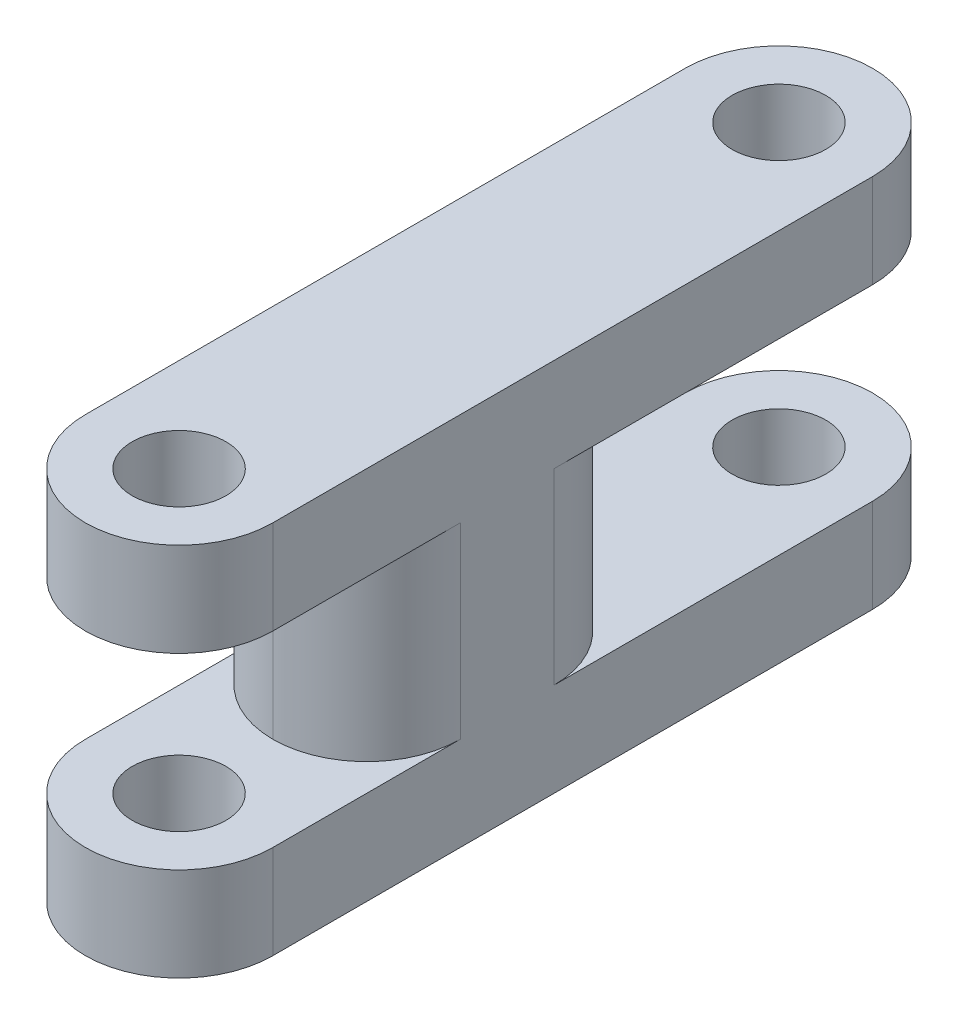
ISO-10303-21;
HEADER;
FILE_DESCRIPTION(('STEP AP214'),'2;1');
FILE_NAME('part.step','',(''),(''),'','','');
FILE_SCHEMA(('AUTOMOTIVE_DESIGN { 1 0 10303 214 1 1 1 1 }'));
ENDSEC;
DATA;
#1=APPLICATION_CONTEXT('core data for automotive mechanical design processes');
#2=APPLICATION_PROTOCOL_DEFINITION('international standard','automotive_design',2000,#1);
#3=PRODUCT_CONTEXT('',#1,'mechanical');
#4=PRODUCT('Part','Part','',(#3));
#5=PRODUCT_RELATED_PRODUCT_CATEGORY('part','',(#4));
#6=PRODUCT_DEFINITION_FORMATION('','',#4);
#7=PRODUCT_DEFINITION_CONTEXT('part definition',#1,'design');
#8=PRODUCT_DEFINITION('design','',#6,#7);
#9=PRODUCT_DEFINITION_SHAPE('','',#8);
#10=(LENGTH_UNIT() NAMED_UNIT(*) SI_UNIT(.MILLI.,.METRE.));
#11=(NAMED_UNIT(*) PLANE_ANGLE_UNIT() SI_UNIT($,.RADIAN.));
#12=(NAMED_UNIT(*) SI_UNIT($,.STERADIAN.) SOLID_ANGLE_UNIT());
#13=UNCERTAINTY_MEASURE_WITH_UNIT(LENGTH_MEASURE(1.E-05),#10,'distance_accuracy_value','');
#14=(GEOMETRIC_REPRESENTATION_CONTEXT(3) GLOBAL_UNCERTAINTY_ASSIGNED_CONTEXT((#13)) GLOBAL_UNIT_ASSIGNED_CONTEXT((#10,
#11,#12)) REPRESENTATION_CONTEXT('',''));
#15=CARTESIAN_POINT('',(0.,0.,0.));
#16=DIRECTION('',(0.,0.,1.));
#17=DIRECTION('',(1.,0.,0.));
#18=AXIS2_PLACEMENT_3D('',#15,#16,#17);
#19=CARTESIAN_POINT('',(0.,20.,-32.));
#20=DIRECTION('',(0.,-1.,0.));
#21=DIRECTION('',(0.,0.,-1.));
#22=AXIS2_PLACEMENT_3D('',#19,#20,#21);
#23=CYLINDRICAL_SURFACE('',#22,5.);
#24=CARTESIAN_POINT('',(0.,15.,-32.));
#25=DIRECTION('',(0.,-1.,0.));
#26=DIRECTION('',(0.,0.,-1.));
#27=AXIS2_PLACEMENT_3D('',#24,#25,#26);
#28=CIRCLE('',#27,5.);
#29=CARTESIAN_POINT('',(-5.,15.,-32.));
#30=VERTEX_POINT('',#29);
#31=CARTESIAN_POINT('',(5.,15.,-32.));
#32=VERTEX_POINT('',#31);
#33=EDGE_CURVE('E140',#30,#32,#28,.T.);
#34=ORIENTED_EDGE('',*,*,#33,.F.);
#35=DIRECTION('',(0.,-1.,0.));
#36=VECTOR('',#35,1.);
#37=CARTESIAN_POINT('',(-5.,20.,-32.));
#38=LINE('',#37,#36);
#39=CARTESIAN_POINT('',(-5.,20.,-32.));
#40=VERTEX_POINT('',#39);
#41=EDGE_CURVE('E173',#40,#30,#38,.T.);
#42=ORIENTED_EDGE('',*,*,#41,.F.);
#43=CARTESIAN_POINT('',(0.,20.,-32.));
#44=DIRECTION('',(0.,1.,0.));
#45=DIRECTION('',(0.,0.,1.));
#46=AXIS2_PLACEMENT_3D('',#43,#44,#45);
#47=CIRCLE('',#46,5.);
#48=CARTESIAN_POINT('',(5.,20.,-32.));
#49=VERTEX_POINT('',#48);
#50=EDGE_CURVE('E164',#49,#40,#47,.T.);
#51=ORIENTED_EDGE('',*,*,#50,.F.);
#52=DIRECTION('',(0.,-1.,0.));
#53=VECTOR('',#52,1.);
#54=CARTESIAN_POINT('',(5.,20.,-32.));
#55=LINE('',#54,#53);
#56=EDGE_CURVE('E156',#49,#32,#55,.T.);
#57=ORIENTED_EDGE('',*,*,#56,.T.);
#58=EDGE_LOOP('',(#34,#42,#51,#57));
#59=FACE_BOUND('',#58,.T.);
#60=ADVANCED_FACE('F39',(#59),#23,.T.);
#61=CARTESIAN_POINT('',(5.,20.,0.));
#62=DIRECTION('',(-1.,0.,0.));
#63=DIRECTION('',(0.,0.,1.));
#64=AXIS2_PLACEMENT_3D('',#61,#62,#63);
#65=PLANE('',#64);
#66=DIRECTION('',(0.,1.,0.));
#67=VECTOR('',#66,1.);
#68=CARTESIAN_POINT('',(5.,20.,-15.));
#69=LINE('',#68,#67);
#70=CARTESIAN_POINT('',(5.,5.,-15.));
#71=VERTEX_POINT('',#70);
#72=CARTESIAN_POINT('',(5.,15.,-15.));
#73=VERTEX_POINT('',#72);
#74=EDGE_CURVE('E159',#71,#73,#69,.T.);
#75=ORIENTED_EDGE('',*,*,#74,.T.);
#76=DIRECTION('',(0.,0.,-1.));
#77=VECTOR('',#76,1.);
#78=CARTESIAN_POINT('',(5.,15.,-35.));
#79=LINE('',#78,#77);
#80=EDGE_CURVE('E143',#73,#32,#79,.T.);
#81=ORIENTED_EDGE('',*,*,#80,.T.);
#82=ORIENTED_EDGE('',*,*,#56,.F.);
#83=DIRECTION('',(0.,0.,-1.));
#84=VECTOR('',#83,1.);
#85=CARTESIAN_POINT('',(5.,20.,0.));
#86=LINE('',#85,#84);
#87=CARTESIAN_POINT('',(5.,20.,0.));
#88=VERTEX_POINT('',#87);
#89=EDGE_CURVE('E292',#88,#49,#86,.T.);
#90=ORIENTED_EDGE('',*,*,#89,.F.);
#91=DIRECTION('',(0.,-1.,0.));
#92=VECTOR('',#91,1.);
#93=CARTESIAN_POINT('',(5.,20.,0.));
#94=LINE('',#93,#92);
#95=CARTESIAN_POINT('',(5.,15.,0.));
#96=VERTEX_POINT('',#95);
#97=EDGE_CURVE('E171',#88,#96,#94,.T.);
#98=ORIENTED_EDGE('',*,*,#97,.T.);
#99=DIRECTION('',(0.,0.,1.));
#100=VECTOR('',#99,1.);
#101=CARTESIAN_POINT('',(5.,15.,5.));
#102=LINE('',#101,#100);
#103=CARTESIAN_POINT('',(5.,15.,-10.));
#104=VERTEX_POINT('',#103);
#105=EDGE_CURVE('E185',#104,#96,#102,.T.);
#106=ORIENTED_EDGE('',*,*,#105,.F.);
#107=DIRECTION('',(0.,1.,0.));
#108=VECTOR('',#107,1.);
#109=CARTESIAN_POINT('',(5.,20.,-10.));
#110=LINE('',#109,#108);
#111=CARTESIAN_POINT('',(5.,5.,-10.));
#112=VERTEX_POINT('',#111);
#113=EDGE_CURVE('E203',#104,#112,#110,.F.);
#114=ORIENTED_EDGE('',*,*,#113,.T.);
#115=DIRECTION('',(0.,0.,-1.));
#116=VECTOR('',#115,1.);
#117=CARTESIAN_POINT('',(5.,5.,5.));
#118=LINE('',#117,#116);
#119=CARTESIAN_POINT('',(5.,5.,0.));
#120=VERTEX_POINT('',#119);
#121=EDGE_CURVE('E255',#120,#112,#118,.T.);
#122=ORIENTED_EDGE('',*,*,#121,.F.);
#123=CARTESIAN_POINT('',(5.,0.,0.));
#124=VERTEX_POINT('',#123);
#125=EDGE_CURVE('E166',#120,#124,#94,.T.);
#126=ORIENTED_EDGE('',*,*,#125,.T.);
#127=DIRECTION('',(0.,0.,-1.));
#128=VECTOR('',#127,1.);
#129=CARTESIAN_POINT('',(5.,0.,0.));
#130=LINE('',#129,#128);
#131=CARTESIAN_POINT('',(5.,0.,-32.));
#132=VERTEX_POINT('',#131);
#133=EDGE_CURVE('E305',#124,#132,#130,.T.);
#134=ORIENTED_EDGE('',*,*,#133,.T.);
#135=CARTESIAN_POINT('',(5.,5.,-32.));
#136=VERTEX_POINT('',#135);
#137=EDGE_CURVE('E167',#136,#132,#55,.T.);
#138=ORIENTED_EDGE('',*,*,#137,.F.);
#139=DIRECTION('',(0.,0.,1.));
#140=VECTOR('',#139,1.);
#141=CARTESIAN_POINT('',(5.,5.,-35.));
#142=LINE('',#141,#140);
#143=EDGE_CURVE('E161',#136,#71,#142,.T.);
#144=ORIENTED_EDGE('',*,*,#143,.T.);
#145=EDGE_LOOP('',(#75,#81,#82,#90,#98,#106,#114,#122,#126,#134,#138,#144));
#146=FACE_BOUND('',#145,.T.);
#147=ADVANCED_FACE('F155',(#146),#65,.F.);
#148=CARTESIAN_POINT('',(-5.,5.,-32.));
#149=VERTEX_POINT('',#148);
#150=CARTESIAN_POINT('',(-5.,0.,-32.));
#151=VERTEX_POINT('',#150);
#152=EDGE_CURVE('E318',#149,#151,#38,.T.);
#153=ORIENTED_EDGE('',*,*,#152,.F.);
#154=CARTESIAN_POINT('',(0.,5.,-32.));
#155=DIRECTION('',(0.,1.,0.));
#156=DIRECTION('',(0.,0.,1.));
#157=AXIS2_PLACEMENT_3D('',#154,#155,#156);
#158=CIRCLE('',#157,5.);
#159=EDGE_CURVE('E252',#136,#149,#158,.T.);
#160=ORIENTED_EDGE('',*,*,#159,.F.);
#161=ORIENTED_EDGE('',*,*,#137,.T.);
#162=CARTESIAN_POINT('',(0.,0.,-32.));
#163=DIRECTION('',(0.,1.,0.));
#164=DIRECTION('',(0.,0.,1.));
#165=AXIS2_PLACEMENT_3D('',#162,#163,#164);
#166=CIRCLE('',#165,5.);
#167=EDGE_CURVE('E309',#132,#151,#166,.T.);
#168=ORIENTED_EDGE('',*,*,#167,.T.);
#169=EDGE_LOOP('',(#153,#160,#161,#168));
#170=FACE_BOUND('',#169,.T.);
#171=ADVANCED_FACE('F365',(#170),#23,.T.);
#172=CARTESIAN_POINT('',(-5.,20.,0.));
#173=DIRECTION('',(1.,0.,0.));
#174=DIRECTION('',(0.,0.,-1.));
#175=AXIS2_PLACEMENT_3D('',#172,#173,#174);
#176=PLANE('',#175);
#177=DIRECTION('',(0.,-1.,0.));
#178=VECTOR('',#177,1.);
#179=CARTESIAN_POINT('',(-5.,20.,-15.));
#180=LINE('',#179,#178);
#181=CARTESIAN_POINT('',(-5.,15.,-15.));
#182=VERTEX_POINT('',#181);
#183=CARTESIAN_POINT('',(-5.,5.,-15.));
#184=VERTEX_POINT('',#183);
#185=EDGE_CURVE('E221',#182,#184,#180,.T.);
#186=ORIENTED_EDGE('',*,*,#185,.T.);
#187=DIRECTION('',(0.,0.,1.));
#188=VECTOR('',#187,1.);
#189=CARTESIAN_POINT('',(-5.,5.,0.));
#190=LINE('',#189,#188);
#191=EDGE_CURVE('E199',#149,#184,#190,.T.);
#192=ORIENTED_EDGE('',*,*,#191,.F.);
#193=ORIENTED_EDGE('',*,*,#152,.T.);
#194=DIRECTION('',(0.,0.,1.));
#195=VECTOR('',#194,1.);
#196=CARTESIAN_POINT('',(-5.,0.,0.));
#197=LINE('',#196,#195);
#198=CARTESIAN_POINT('',(-5.,0.,0.));
#199=VERTEX_POINT('',#198);
#200=EDGE_CURVE('E293',#151,#199,#197,.T.);
#201=ORIENTED_EDGE('',*,*,#200,.T.);
#202=DIRECTION('',(0.,-1.,0.));
#203=VECTOR('',#202,1.);
#204=CARTESIAN_POINT('',(-5.,20.,0.));
#205=LINE('',#204,#203);
#206=CARTESIAN_POINT('',(-5.,5.,0.));
#207=VERTEX_POINT('',#206);
#208=EDGE_CURVE('E301',#207,#199,#205,.T.);
#209=ORIENTED_EDGE('',*,*,#208,.F.);
#210=DIRECTION('',(0.,0.,-1.));
#211=VECTOR('',#210,1.);
#212=CARTESIAN_POINT('',(-5.,5.,0.));
#213=LINE('',#212,#211);
#214=CARTESIAN_POINT('',(-5.,5.,-10.));
#215=VERTEX_POINT('',#214);
#216=EDGE_CURVE('E184',#207,#215,#213,.T.);
#217=ORIENTED_EDGE('',*,*,#216,.T.);
#218=DIRECTION('',(0.,1.,0.));
#219=VECTOR('',#218,1.);
#220=CARTESIAN_POINT('',(-5.,20.,-10.));
#221=LINE('',#220,#219);
#222=CARTESIAN_POINT('',(-5.,15.,-10.));
#223=VERTEX_POINT('',#222);
#224=EDGE_CURVE('E179',#215,#223,#221,.T.);
#225=ORIENTED_EDGE('',*,*,#224,.T.);
#226=DIRECTION('',(0.,0.,1.));
#227=VECTOR('',#226,1.);
#228=CARTESIAN_POINT('',(-5.,15.,0.));
#229=LINE('',#228,#227);
#230=CARTESIAN_POINT('',(-5.,15.,0.));
#231=VERTEX_POINT('',#230);
#232=EDGE_CURVE('E190',#223,#231,#229,.T.);
#233=ORIENTED_EDGE('',*,*,#232,.T.);
#234=CARTESIAN_POINT('',(-5.,20.,0.));
#235=VERTEX_POINT('',#234);
#236=EDGE_CURVE('E315',#235,#231,#205,.T.);
#237=ORIENTED_EDGE('',*,*,#236,.F.);
#238=DIRECTION('',(0.,0.,1.));
#239=VECTOR('',#238,1.);
#240=CARTESIAN_POINT('',(-5.,20.,0.));
#241=LINE('',#240,#239);
#242=EDGE_CURVE('E298',#40,#235,#241,.T.);
#243=ORIENTED_EDGE('',*,*,#242,.F.);
#244=ORIENTED_EDGE('',*,*,#41,.T.);
#245=DIRECTION('',(0.,0.,-1.));
#246=VECTOR('',#245,1.);
#247=CARTESIAN_POINT('',(-5.,15.,0.));
#248=LINE('',#247,#246);
#249=EDGE_CURVE('E145',#182,#30,#248,.T.);
#250=ORIENTED_EDGE('',*,*,#249,.F.);
#251=EDGE_LOOP('',(#186,#192,#193,#201,#209,#217,#225,#233,#237,#243,#244,#250));
#252=FACE_BOUND('',#251,.T.);
#253=ADVANCED_FACE('F243',(#252),#176,.F.);
#254=CARTESIAN_POINT('',(0.,20.,-32.));
#255=DIRECTION('',(0.,-1.,0.));
#256=DIRECTION('',(0.,0.,-1.));
#257=AXIS2_PLACEMENT_3D('',#254,#255,#256);
#258=CYLINDRICAL_SURFACE('',#257,2.5);
#259=CARTESIAN_POINT('',(0.,0.,-32.));
#260=DIRECTION('',(0.,1.,0.));
#261=DIRECTION('',(0.,0.,1.));
#262=AXIS2_PLACEMENT_3D('',#259,#260,#261);
#263=CIRCLE('',#262,2.5);
#264=CARTESIAN_POINT('',(0.,0.,-29.5));
#265=VERTEX_POINT('',#264);
#266=EDGE_CURVE('E276',#265,#265,#263,.T.);
#267=ORIENTED_EDGE('',*,*,#266,.F.);
#268=EDGE_LOOP('',(#267));
#269=FACE_BOUND('',#268,.T.);
#270=CARTESIAN_POINT('',(0.,5.,-32.));
#271=DIRECTION('',(0.,1.,0.));
#272=DIRECTION('',(0.,0.,1.));
#273=AXIS2_PLACEMENT_3D('',#270,#271,#272);
#274=CIRCLE('',#273,2.5);
#275=CARTESIAN_POINT('',(0.,5.,-29.5));
#276=VERTEX_POINT('',#275);
#277=EDGE_CURVE('E151',#276,#276,#274,.T.);
#278=ORIENTED_EDGE('',*,*,#277,.T.);
#279=EDGE_LOOP('',(#278));
#280=FACE_BOUND('',#279,.T.);
#281=ADVANCED_FACE('F376',(#269,#280),#258,.F.);
#282=CARTESIAN_POINT('',(0.,20.,-32.));
#283=DIRECTION('',(0.,1.,0.));
#284=DIRECTION('',(0.,0.,1.));
#285=AXIS2_PLACEMENT_3D('',#282,#283,#284);
#286=CIRCLE('',#285,2.5);
#287=CARTESIAN_POINT('',(0.,20.,-29.5));
#288=VERTEX_POINT('',#287);
#289=EDGE_CURVE('E280',#288,#288,#286,.T.);
#290=ORIENTED_EDGE('',*,*,#289,.T.);
#291=EDGE_LOOP('',(#290));
#292=FACE_BOUND('',#291,.T.);
#293=CARTESIAN_POINT('',(0.,15.,-32.));
#294=DIRECTION('',(0.,-1.,0.));
#295=DIRECTION('',(0.,0.,-1.));
#296=AXIS2_PLACEMENT_3D('',#293,#294,#295);
#297=CIRCLE('',#296,2.5);
#298=CARTESIAN_POINT('',(0.,15.,-34.5));
#299=VERTEX_POINT('',#298);
#300=EDGE_CURVE('E192',#299,#299,#297,.T.);
#301=ORIENTED_EDGE('',*,*,#300,.T.);
#302=EDGE_LOOP('',(#301));
#303=FACE_BOUND('',#302,.T.);
#304=ADVANCED_FACE('F467',(#292,#303),#258,.F.);
#305=CARTESIAN_POINT('',(0.,20.,0.));
#306=DIRECTION('',(0.,-1.,0.));
#307=DIRECTION('',(0.,0.,-1.));
#308=AXIS2_PLACEMENT_3D('',#305,#306,#307);
#309=CYLINDRICAL_SURFACE('',#308,5.);
#310=CARTESIAN_POINT('',(0.,15.,0.));
#311=DIRECTION('',(0.,1.,0.));
#312=DIRECTION('',(0.,0.,1.));
#313=AXIS2_PLACEMENT_3D('',#310,#311,#312);
#314=CIRCLE('',#313,5.);
#315=EDGE_CURVE('E268',#231,#96,#314,.T.);
#316=ORIENTED_EDGE('',*,*,#315,.T.);
#317=ORIENTED_EDGE('',*,*,#97,.F.);
#318=CARTESIAN_POINT('',(0.,20.,0.));
#319=DIRECTION('',(0.,1.,0.));
#320=DIRECTION('',(0.,0.,1.));
#321=AXIS2_PLACEMENT_3D('',#318,#319,#320);
#322=CIRCLE('',#321,5.);
#323=EDGE_CURVE('E288',#235,#88,#322,.T.);
#324=ORIENTED_EDGE('',*,*,#323,.F.);
#325=ORIENTED_EDGE('',*,*,#236,.T.);
#326=EDGE_LOOP('',(#316,#317,#324,#325));
#327=FACE_BOUND('',#326,.T.);
#328=ADVANCED_FACE('F471',(#327),#309,.T.);
#329=CARTESIAN_POINT('',(0.,20.,0.));
#330=DIRECTION('',(0.,-1.,0.));
#331=DIRECTION('',(0.,0.,-1.));
#332=AXIS2_PLACEMENT_3D('',#329,#330,#331);
#333=CYLINDRICAL_SURFACE('',#332,2.5);
#334=CARTESIAN_POINT('',(0.,15.,0.));
#335=DIRECTION('',(0.,1.,0.));
#336=DIRECTION('',(0.,0.,1.));
#337=AXIS2_PLACEMENT_3D('',#334,#335,#336);
#338=CIRCLE('',#337,2.5);
#339=CARTESIAN_POINT('',(0.,15.,2.5));
#340=VERTEX_POINT('',#339);
#341=EDGE_CURVE('E186',#340,#340,#338,.T.);
#342=ORIENTED_EDGE('',*,*,#341,.F.);
#343=EDGE_LOOP('',(#342));
#344=FACE_BOUND('',#343,.T.);
#345=CARTESIAN_POINT('',(0.,20.,0.));
#346=DIRECTION('',(0.,1.,0.));
#347=DIRECTION('',(0.,0.,1.));
#348=AXIS2_PLACEMENT_3D('',#345,#346,#347);
#349=CIRCLE('',#348,2.5);
#350=CARTESIAN_POINT('',(0.,20.,2.5));
#351=VERTEX_POINT('',#350);
#352=EDGE_CURVE('E272',#351,#351,#349,.T.);
#353=ORIENTED_EDGE('',*,*,#352,.T.);
#354=EDGE_LOOP('',(#353));
#355=FACE_BOUND('',#354,.T.);
#356=ADVANCED_FACE('F489',(#344,#355),#333,.F.);
#357=CARTESIAN_POINT('',(0.,20.,0.));
#358=DIRECTION('',(0.,1.,0.));
#359=DIRECTION('',(0.,0.,1.));
#360=AXIS2_PLACEMENT_3D('',#357,#358,#359);
#361=PLANE('',#360);
#362=ORIENTED_EDGE('',*,*,#289,.F.);
#363=EDGE_LOOP('',(#362));
#364=FACE_BOUND('',#363,.T.);
#365=ORIENTED_EDGE('',*,*,#323,.T.);
#366=ORIENTED_EDGE('',*,*,#89,.T.);
#367=ORIENTED_EDGE('',*,*,#50,.T.);
#368=ORIENTED_EDGE('',*,*,#242,.T.);
#369=EDGE_LOOP('',(#365,#366,#367,#368));
#370=FACE_BOUND('',#369,.T.);
#371=ORIENTED_EDGE('',*,*,#352,.F.);
#372=EDGE_LOOP('',(#371));
#373=FACE_BOUND('',#372,.T.);
#374=ADVANCED_FACE('F507',(#364,#370,#373),#361,.T.);
#375=CARTESIAN_POINT('',(0.,0.,0.));
#376=DIRECTION('',(0.,1.,0.));
#377=DIRECTION('',(0.,0.,1.));
#378=AXIS2_PLACEMENT_3D('',#375,#376,#377);
#379=PLANE('',#378);
#380=CARTESIAN_POINT('',(0.,0.,0.));
#381=DIRECTION('',(0.,1.,0.));
#382=DIRECTION('',(0.,0.,1.));
#383=AXIS2_PLACEMENT_3D('',#380,#381,#382);
#384=CIRCLE('',#383,5.);
#385=EDGE_CURVE('E284',#199,#124,#384,.T.);
#386=ORIENTED_EDGE('',*,*,#385,.F.);
#387=ORIENTED_EDGE('',*,*,#200,.F.);
#388=ORIENTED_EDGE('',*,*,#167,.F.);
#389=ORIENTED_EDGE('',*,*,#133,.F.);
#390=EDGE_LOOP('',(#386,#387,#388,#389));
#391=FACE_BOUND('',#390,.T.);
#392=ORIENTED_EDGE('',*,*,#266,.T.);
#393=EDGE_LOOP('',(#392));
#394=FACE_BOUND('',#393,.T.);
#395=CARTESIAN_POINT('',(0.,0.,0.));
#396=DIRECTION('',(0.,1.,0.));
#397=DIRECTION('',(0.,0.,1.));
#398=AXIS2_PLACEMENT_3D('',#395,#396,#397);
#399=CIRCLE('',#398,2.5);
#400=CARTESIAN_POINT('',(0.,0.,2.5));
#401=VERTEX_POINT('',#400);
#402=EDGE_CURVE('E271',#401,#401,#399,.T.);
#403=ORIENTED_EDGE('',*,*,#402,.T.);
#404=EDGE_LOOP('',(#403));
#405=FACE_BOUND('',#404,.T.);
#406=ADVANCED_FACE('F334',(#391,#394,#405),#379,.F.);
#407=ORIENTED_EDGE('',*,*,#125,.F.);
#408=CARTESIAN_POINT('',(0.,5.,0.));
#409=DIRECTION('',(0.,-1.,0.));
#410=DIRECTION('',(0.,0.,-1.));
#411=AXIS2_PLACEMENT_3D('',#408,#409,#410);
#412=CIRCLE('',#411,5.);
#413=EDGE_CURVE('E191',#120,#207,#412,.T.);
#414=ORIENTED_EDGE('',*,*,#413,.T.);
#415=ORIENTED_EDGE('',*,*,#208,.T.);
#416=ORIENTED_EDGE('',*,*,#385,.T.);
#417=EDGE_LOOP('',(#407,#414,#415,#416));
#418=FACE_BOUND('',#417,.T.);
#419=ADVANCED_FACE('F327',(#418),#309,.T.);
#420=CARTESIAN_POINT('',(0.,5.,0.));
#421=DIRECTION('',(0.,-1.,0.));
#422=DIRECTION('',(0.,0.,-1.));
#423=AXIS2_PLACEMENT_3D('',#420,#421,#422);
#424=CIRCLE('',#423,2.5);
#425=CARTESIAN_POINT('',(0.,5.,-2.5));
#426=VERTEX_POINT('',#425);
#427=EDGE_CURVE('E180',#426,#426,#424,.T.);
#428=ORIENTED_EDGE('',*,*,#427,.F.);
#429=EDGE_LOOP('',(#428));
#430=FACE_BOUND('',#429,.T.);
#431=ORIENTED_EDGE('',*,*,#402,.F.);
#432=EDGE_LOOP('',(#431));
#433=FACE_BOUND('',#432,.T.);
#434=ADVANCED_FACE('F459',(#430,#433),#333,.F.);
#435=CARTESIAN_POINT('',(-10.,15.,5.));
#436=DIRECTION('',(0.,1.,0.));
#437=DIRECTION('',(0.,0.,1.));
#438=AXIS2_PLACEMENT_3D('',#435,#436,#437);
#439=PLANE('',#438);
#440=ORIENTED_EDGE('',*,*,#341,.T.);
#441=EDGE_LOOP('',(#440));
#442=FACE_BOUND('',#441,.T.);
#443=ORIENTED_EDGE('',*,*,#315,.F.);
#444=ORIENTED_EDGE('',*,*,#232,.F.);
#445=CARTESIAN_POINT('',(0.,15.,-10.));
#446=DIRECTION('',(0.,1.,0.));
#447=DIRECTION('',(0.,0.,1.));
#448=AXIS2_PLACEMENT_3D('',#445,#446,#447);
#449=CIRCLE('',#448,5.);
#450=CARTESIAN_POINT('',(0.,15.,-5.));
#451=VERTEX_POINT('',#450);
#452=EDGE_CURVE('E207',#223,#451,#449,.T.);
#453=ORIENTED_EDGE('',*,*,#452,.T.);
#454=CARTESIAN_POINT('',(0.,15.,-10.));
#455=DIRECTION('',(0.,1.,0.));
#456=DIRECTION('',(0.,0.,1.));
#457=AXIS2_PLACEMENT_3D('',#454,#455,#456);
#458=CIRCLE('',#457,5.);
#459=EDGE_CURVE('E214',#451,#104,#458,.T.);
#460=ORIENTED_EDGE('',*,*,#459,.T.);
#461=ORIENTED_EDGE('',*,*,#105,.T.);
#462=EDGE_LOOP('',(#443,#444,#453,#460,#461));
#463=FACE_BOUND('',#462,.T.);
#464=ADVANCED_FACE('F350',(#442,#463),#439,.F.);
#465=CARTESIAN_POINT('',(-10.,5.,5.));
#466=DIRECTION('',(0.,-1.,0.));
#467=DIRECTION('',(0.,0.,-1.));
#468=AXIS2_PLACEMENT_3D('',#465,#466,#467);
#469=PLANE('',#468);
#470=ORIENTED_EDGE('',*,*,#427,.T.);
#471=EDGE_LOOP('',(#470));
#472=FACE_BOUND('',#471,.T.);
#473=ORIENTED_EDGE('',*,*,#121,.T.);
#474=CARTESIAN_POINT('',(0.,5.,-10.));
#475=DIRECTION('',(0.,-1.,0.));
#476=DIRECTION('',(0.,0.,-1.));
#477=AXIS2_PLACEMENT_3D('',#474,#475,#476);
#478=CIRCLE('',#477,5.);
#479=CARTESIAN_POINT('',(0.,5.,-5.));
#480=VERTEX_POINT('',#479);
#481=EDGE_CURVE('E218',#112,#480,#478,.T.);
#482=ORIENTED_EDGE('',*,*,#481,.T.);
#483=CARTESIAN_POINT('',(0.,5.,-10.));
#484=DIRECTION('',(0.,-1.,0.));
#485=DIRECTION('',(0.,0.,-1.));
#486=AXIS2_PLACEMENT_3D('',#483,#484,#485);
#487=CIRCLE('',#486,5.);
#488=EDGE_CURVE('E210',#480,#215,#487,.T.);
#489=ORIENTED_EDGE('',*,*,#488,.T.);
#490=ORIENTED_EDGE('',*,*,#216,.F.);
#491=ORIENTED_EDGE('',*,*,#413,.F.);
#492=EDGE_LOOP('',(#473,#482,#489,#490,#491));
#493=FACE_BOUND('',#492,.T.);
#494=ADVANCED_FACE('F341',(#472,#493),#469,.F.);
#495=CARTESIAN_POINT('',(-10.,5.,-35.));
#496=DIRECTION('',(0.,1.,0.));
#497=DIRECTION('',(0.,0.,1.));
#498=AXIS2_PLACEMENT_3D('',#495,#496,#497);
#499=PLANE('',#498);
#500=CARTESIAN_POINT('',(0.,5.,-15.));
#501=DIRECTION('',(0.,1.,0.));
#502=DIRECTION('',(0.,0.,1.));
#503=AXIS2_PLACEMENT_3D('',#500,#501,#502);
#504=CIRCLE('',#503,5.);
#505=CARTESIAN_POINT('',(0.,5.,-20.));
#506=VERTEX_POINT('',#505);
#507=EDGE_CURVE('E62',#184,#506,#504,.F.);
#508=ORIENTED_EDGE('',*,*,#507,.T.);
#509=CARTESIAN_POINT('',(0.,5.,-15.));
#510=DIRECTION('',(0.,1.,0.));
#511=DIRECTION('',(0.,0.,1.));
#512=AXIS2_PLACEMENT_3D('',#509,#510,#511);
#513=CIRCLE('',#512,5.);
#514=EDGE_CURVE('E11',#506,#71,#513,.F.);
#515=ORIENTED_EDGE('',*,*,#514,.T.);
#516=ORIENTED_EDGE('',*,*,#143,.F.);
#517=ORIENTED_EDGE('',*,*,#159,.T.);
#518=ORIENTED_EDGE('',*,*,#191,.T.);
#519=EDGE_LOOP('',(#508,#515,#516,#517,#518));
#520=FACE_BOUND('',#519,.T.);
#521=ORIENTED_EDGE('',*,*,#277,.F.);
#522=EDGE_LOOP('',(#521));
#523=FACE_BOUND('',#522,.T.);
#524=ADVANCED_FACE('F360',(#520,#523),#499,.T.);
#525=CARTESIAN_POINT('',(-10.,15.,-35.));
#526=DIRECTION('',(0.,-1.,0.));
#527=DIRECTION('',(0.,0.,-1.));
#528=AXIS2_PLACEMENT_3D('',#525,#526,#527);
#529=PLANE('',#528);
#530=ORIENTED_EDGE('',*,*,#300,.F.);
#531=EDGE_LOOP('',(#530));
#532=FACE_BOUND('',#531,.T.);
#533=ORIENTED_EDGE('',*,*,#33,.T.);
#534=ORIENTED_EDGE('',*,*,#80,.F.);
#535=CARTESIAN_POINT('',(0.,15.,-15.));
#536=DIRECTION('',(0.,-1.,0.));
#537=DIRECTION('',(0.,0.,-1.));
#538=AXIS2_PLACEMENT_3D('',#535,#536,#537);
#539=CIRCLE('',#538,5.);
#540=CARTESIAN_POINT('',(0.,15.,-20.));
#541=VERTEX_POINT('',#540);
#542=EDGE_CURVE('E49',#73,#541,#539,.F.);
#543=ORIENTED_EDGE('',*,*,#542,.T.);
#544=CARTESIAN_POINT('',(0.,15.,-15.));
#545=DIRECTION('',(0.,-1.,0.));
#546=DIRECTION('',(0.,0.,-1.));
#547=AXIS2_PLACEMENT_3D('',#544,#545,#546);
#548=CIRCLE('',#547,5.);
#549=EDGE_CURVE('E232',#541,#182,#548,.F.);
#550=ORIENTED_EDGE('',*,*,#549,.T.);
#551=ORIENTED_EDGE('',*,*,#249,.T.);
#552=EDGE_LOOP('',(#533,#534,#543,#550,#551));
#553=FACE_BOUND('',#552,.T.);
#554=ADVANCED_FACE('F142',(#532,#553),#529,.T.);
#555=CARTESIAN_POINT('',(0.,15.,-10.));
#556=DIRECTION('',(0.,1.,0.));
#557=DIRECTION('',(0.,0.,1.));
#558=AXIS2_PLACEMENT_3D('',#555,#556,#557);
#559=CYLINDRICAL_SURFACE('',#558,5.);
#560=DIRECTION('',(0.,1.,0.));
#561=VECTOR('',#560,1.);
#562=CARTESIAN_POINT('',(0.,15.,-5.));
#563=LINE('',#562,#561);
#564=EDGE_CURVE('E162',#480,#451,#563,.T.);
#565=ORIENTED_EDGE('',*,*,#564,.F.);
#566=ORIENTED_EDGE('',*,*,#481,.F.);
#567=ORIENTED_EDGE('',*,*,#113,.F.);
#568=ORIENTED_EDGE('',*,*,#459,.F.);
#569=EDGE_LOOP('',(#565,#566,#567,#568));
#570=FACE_BOUND('',#569,.T.);
#571=ADVANCED_FACE('F352',(#570),#559,.T.);
#572=CARTESIAN_POINT('',(0.,20.,-10.));
#573=DIRECTION('',(0.,1.,0.));
#574=DIRECTION('',(0.,0.,1.));
#575=AXIS2_PLACEMENT_3D('',#572,#573,#574);
#576=CYLINDRICAL_SURFACE('',#575,5.);
#577=ORIENTED_EDGE('',*,*,#488,.F.);
#578=ORIENTED_EDGE('',*,*,#564,.T.);
#579=ORIENTED_EDGE('',*,*,#452,.F.);
#580=ORIENTED_EDGE('',*,*,#224,.F.);
#581=EDGE_LOOP('',(#577,#578,#579,#580));
#582=FACE_BOUND('',#581,.T.);
#583=ADVANCED_FACE('F347',(#582),#576,.T.);
#584=CARTESIAN_POINT('',(0.,20.,-15.));
#585=DIRECTION('',(0.,1.,0.));
#586=DIRECTION('',(0.,0.,1.));
#587=AXIS2_PLACEMENT_3D('',#584,#585,#586);
#588=CYLINDRICAL_SURFACE('',#587,5.);
#589=DIRECTION('',(0.,1.,0.));
#590=VECTOR('',#589,1.);
#591=CARTESIAN_POINT('',(0.,5.,-20.));
#592=LINE('',#591,#590);
#593=EDGE_CURVE('E43',#541,#506,#592,.F.);
#594=ORIENTED_EDGE('',*,*,#593,.F.);
#595=ORIENTED_EDGE('',*,*,#542,.F.);
#596=ORIENTED_EDGE('',*,*,#74,.F.);
#597=ORIENTED_EDGE('',*,*,#514,.F.);
#598=EDGE_LOOP('',(#594,#595,#596,#597));
#599=FACE_BOUND('',#598,.T.);
#600=ADVANCED_FACE('F41',(#599),#588,.T.);
#601=CARTESIAN_POINT('',(0.,20.,-15.));
#602=DIRECTION('',(0.,-1.,0.));
#603=DIRECTION('',(0.,0.,-1.));
#604=AXIS2_PLACEMENT_3D('',#601,#602,#603);
#605=CYLINDRICAL_SURFACE('',#604,5.);
#606=ORIENTED_EDGE('',*,*,#549,.F.);
#607=ORIENTED_EDGE('',*,*,#593,.T.);
#608=ORIENTED_EDGE('',*,*,#507,.F.);
#609=ORIENTED_EDGE('',*,*,#185,.F.);
#610=EDGE_LOOP('',(#606,#607,#608,#609));
#611=FACE_BOUND('',#610,.T.);
#612=ADVANCED_FACE('F240',(#611),#605,.T.);
#613=CLOSED_SHELL('',(#60,#147,#171,#253,#281,#304,#328,#356,#374,#406,#419,#434,#464,#494,#524,
#554,#571,#583,#600,#612));
#614=MANIFOLD_SOLID_BREP('B2',#613);
#615=ADVANCED_BREP_SHAPE_REPRESENTATION('',(#18,#614),#14);
#616=SHAPE_DEFINITION_REPRESENTATION(#9,#615);
ENDSEC;
END-ISO-10303-21;
